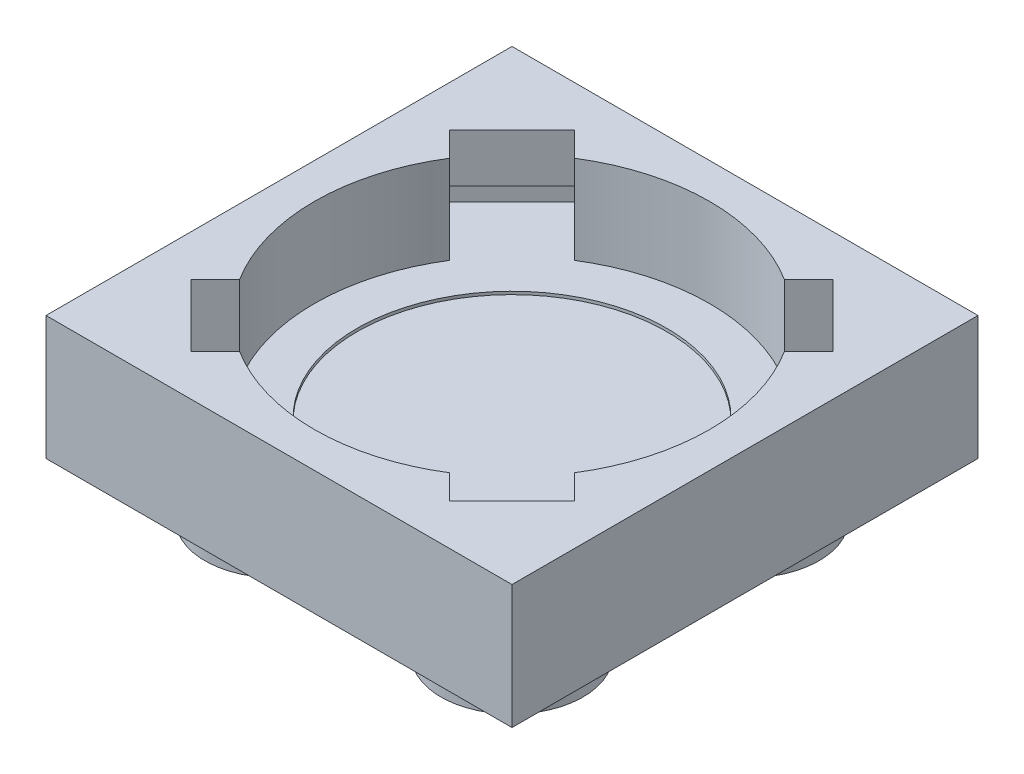
ISO-10303-21;
HEADER;
FILE_DESCRIPTION(('STEP AP214'),'2;1');
FILE_NAME('part.step','',(''),(''),'','','');
FILE_SCHEMA(('AUTOMOTIVE_DESIGN { 1 0 10303 214 1 1 1 1 }'));
ENDSEC;
DATA;
#1=APPLICATION_CONTEXT('core data for automotive mechanical design processes');
#2=APPLICATION_PROTOCOL_DEFINITION('international standard','automotive_design',2000,#1);
#3=PRODUCT_CONTEXT('',#1,'mechanical');
#4=PRODUCT('Part','Part','',(#3));
#5=PRODUCT_RELATED_PRODUCT_CATEGORY('part','',(#4));
#6=PRODUCT_DEFINITION_FORMATION('','',#4);
#7=PRODUCT_DEFINITION_CONTEXT('part definition',#1,'design');
#8=PRODUCT_DEFINITION('design','',#6,#7);
#9=PRODUCT_DEFINITION_SHAPE('','',#8);
#10=(LENGTH_UNIT() NAMED_UNIT(*) SI_UNIT(.MILLI.,.METRE.));
#11=(NAMED_UNIT(*) PLANE_ANGLE_UNIT() SI_UNIT($,.RADIAN.));
#12=(NAMED_UNIT(*) SI_UNIT($,.STERADIAN.) SOLID_ANGLE_UNIT());
#13=UNCERTAINTY_MEASURE_WITH_UNIT(LENGTH_MEASURE(1.E-05),#10,'distance_accuracy_value','');
#14=(GEOMETRIC_REPRESENTATION_CONTEXT(3) GLOBAL_UNCERTAINTY_ASSIGNED_CONTEXT((#13)) GLOBAL_UNIT_ASSIGNED_CONTEXT((#10,
#11,#12)) REPRESENTATION_CONTEXT('',''));
#15=CARTESIAN_POINT('',(0.,0.,0.));
#16=DIRECTION('',(0.,0.,1.));
#17=DIRECTION('',(1.,0.,0.));
#18=AXIS2_PLACEMENT_3D('',#15,#16,#17);
#19=CARTESIAN_POINT('',(7.9,9.47523086789974,-7.9));
#20=DIRECTION('',(0.,-1.,0.));
#21=DIRECTION('',(0.,0.,-1.));
#22=AXIS2_PLACEMENT_3D('',#19,#20,#21);
#23=CYLINDRICAL_SURFACE('',#22,6.7);
#24=CARTESIAN_POINT('',(7.9,-3.,-7.9));
#25=DIRECTION('',(0.,1.,0.));
#26=DIRECTION('',(0.,0.,1.));
#27=AXIS2_PLACEMENT_3D('',#24,#25,#26);
#28=CIRCLE('',#27,6.7);
#29=CARTESIAN_POINT('',(11.4566983804663,-3.,-13.5780187240259));
#30=VERTEX_POINT('',#29);
#31=CARTESIAN_POINT('',(4.34330161953375,-3.,-13.5780187240259));
#32=VERTEX_POINT('',#31);
#33=EDGE_CURVE('E396',#30,#32,#28,.T.);
#34=ORIENTED_EDGE('',*,*,#33,.F.);
#35=DIRECTION('',(0.,-1.,0.));
#36=VECTOR('',#35,1.);
#37=CARTESIAN_POINT('',(11.4566983804663,9.47523086789974,-13.5780187240259));
#38=LINE('',#37,#36);
#39=CARTESIAN_POINT('',(11.4566983804663,0.,-13.5780187240259));
#40=VERTEX_POINT('',#39);
#41=EDGE_CURVE('E81',#30,#40,#38,.F.);
#42=ORIENTED_EDGE('',*,*,#41,.T.);
#43=CARTESIAN_POINT('',(7.9,0.,-7.9));
#44=DIRECTION('',(0.,-1.,0.));
#45=DIRECTION('',(0.,0.,-1.));
#46=AXIS2_PLACEMENT_3D('',#43,#44,#45);
#47=CIRCLE('',#46,6.7);
#48=CARTESIAN_POINT('',(4.34330161953375,0.,-13.5780187240259));
#49=VERTEX_POINT('',#48);
#50=EDGE_CURVE('E410',#49,#40,#47,.T.);
#51=ORIENTED_EDGE('',*,*,#50,.F.);
#52=DIRECTION('',(0.,-1.,0.));
#53=VECTOR('',#52,1.);
#54=CARTESIAN_POINT('',(4.34330161953375,9.47523086789974,-13.5780187240259));
#55=LINE('',#54,#53);
#56=EDGE_CURVE('E484',#32,#49,#55,.F.);
#57=ORIENTED_EDGE('',*,*,#56,.F.);
#58=EDGE_LOOP('',(#34,#42,#51,#57));
#59=FACE_BOUND('',#58,.T.);
#60=ADVANCED_FACE('F73',(#59),#23,.F.);
#61=DIRECTION('',(0.,-1.,0.));
#62=VECTOR('',#61,1.);
#63=CARTESIAN_POINT('',(13.5780187240259,9.47523086789974,-11.4566983804662));
#64=LINE('',#63,#62);
#65=CARTESIAN_POINT('',(13.5780187240259,-3.,-11.4566983804662));
#66=VERTEX_POINT('',#65);
#67=CARTESIAN_POINT('',(13.5780187240259,0.,-11.4566983804662));
#68=VERTEX_POINT('',#67);
#69=EDGE_CURVE('E13',#66,#68,#64,.F.);
#70=ORIENTED_EDGE('',*,*,#69,.F.);
#71=CARTESIAN_POINT('',(13.5780187240259,-3.,-4.34330161953374));
#72=VERTEX_POINT('',#71);
#73=EDGE_CURVE('E510',#72,#66,#28,.T.);
#74=ORIENTED_EDGE('',*,*,#73,.F.);
#75=DIRECTION('',(0.,-1.,0.));
#76=VECTOR('',#75,1.);
#77=CARTESIAN_POINT('',(13.5780187240259,9.47523086789974,-4.34330161953374));
#78=LINE('',#77,#76);
#79=CARTESIAN_POINT('',(13.5780187240259,0.,-4.34330161953374));
#80=VERTEX_POINT('',#79);
#81=EDGE_CURVE('E491',#72,#80,#78,.F.);
#82=ORIENTED_EDGE('',*,*,#81,.T.);
#83=EDGE_CURVE('E414',#68,#80,#47,.T.);
#84=ORIENTED_EDGE('',*,*,#83,.F.);
#85=EDGE_LOOP('',(#70,#74,#82,#84));
#86=FACE_BOUND('',#85,.T.);
#87=ADVANCED_FACE('F543',(#86),#23,.F.);
#88=DIRECTION('',(0.,-1.,0.));
#89=VECTOR('',#88,1.);
#90=CARTESIAN_POINT('',(11.4566983804663,9.47523086789974,-2.2219812759741));
#91=LINE('',#90,#89);
#92=CARTESIAN_POINT('',(11.4566983804663,-3.,-2.2219812759741));
#93=VERTEX_POINT('',#92);
#94=CARTESIAN_POINT('',(11.4566983804663,0.,-2.2219812759741));
#95=VERTEX_POINT('',#94);
#96=EDGE_CURVE('E494',#93,#95,#91,.F.);
#97=ORIENTED_EDGE('',*,*,#96,.F.);
#98=CARTESIAN_POINT('',(4.34330161953368,-3.,-2.22198127597414));
#99=VERTEX_POINT('',#98);
#100=EDGE_CURVE('E419',#99,#93,#28,.T.);
#101=ORIENTED_EDGE('',*,*,#100,.F.);
#102=DIRECTION('',(0.,-1.,0.));
#103=VECTOR('',#102,1.);
#104=CARTESIAN_POINT('',(4.34330161953368,9.47523086789974,-2.22198127597414));
#105=LINE('',#104,#103);
#106=CARTESIAN_POINT('',(4.34330161953368,0.,-2.22198127597414));
#107=VERTEX_POINT('',#106);
#108=EDGE_CURVE('E486',#99,#107,#105,.F.);
#109=ORIENTED_EDGE('',*,*,#108,.T.);
#110=EDGE_CURVE('E524',#95,#107,#47,.T.);
#111=ORIENTED_EDGE('',*,*,#110,.F.);
#112=EDGE_LOOP('',(#97,#101,#109,#111));
#113=FACE_BOUND('',#112,.T.);
#114=ADVANCED_FACE('F521',(#113),#23,.F.);
#115=CARTESIAN_POINT('',(0.,-3.,0.));
#116=DIRECTION('',(0.,-1.,0.));
#117=DIRECTION('',(0.,0.,-1.));
#118=AXIS2_PLACEMENT_3D('',#115,#116,#117);
#119=PLANE('',#118);
#120=CARTESIAN_POINT('',(7.9,-3.,-7.9));
#121=DIRECTION('',(0.,1.,0.));
#122=DIRECTION('',(0.,0.,1.));
#123=AXIS2_PLACEMENT_3D('',#120,#121,#122);
#124=CIRCLE('',#123,5.25);
#125=CARTESIAN_POINT('',(7.9,-3.,-2.65));
#126=VERTEX_POINT('',#125);
#127=EDGE_CURVE('E413',#126,#126,#124,.T.);
#128=ORIENTED_EDGE('',*,*,#127,.F.);
#129=EDGE_LOOP('',(#128));
#130=FACE_BOUND('',#129,.T.);
#131=ORIENTED_EDGE('',*,*,#73,.T.);
#132=DIRECTION('',(0.707106781186549,0.,-0.707106781186546));
#133=VECTOR('',#132,1.);
#134=CARTESIAN_POINT('',(8.96066017177984,-3.,-6.83933982822018));
#135=LINE('',#134,#133);
#136=CARTESIAN_POINT('',(15.2892658633994,-3.,-13.1679455198398));
#137=VERTEX_POINT('',#136);
#138=EDGE_CURVE('E274',#66,#137,#135,.T.);
#139=ORIENTED_EDGE('',*,*,#138,.T.);
#140=DIRECTION('',(0.707106781186545,0.,0.70710678118655));
#141=VECTOR('',#140,1.);
#142=CARTESIAN_POINT('',(13.1679455198398,-3.,-15.2892658633994));
#143=LINE('',#142,#141);
#144=CARTESIAN_POINT('',(13.1679455198398,-3.,-15.2892658633994));
#145=VERTEX_POINT('',#144);
#146=EDGE_CURVE('E271',#145,#137,#143,.T.);
#147=ORIENTED_EDGE('',*,*,#146,.F.);
#148=DIRECTION('',(0.707106781186551,0.,-0.707106781186544));
#149=VECTOR('',#148,1.);
#150=CARTESIAN_POINT('',(6.83933982822017,-3.,-8.96066017177982));
#151=LINE('',#150,#149);
#152=EDGE_CURVE('E257',#30,#145,#151,.T.);
#153=ORIENTED_EDGE('',*,*,#152,.F.);
#154=ORIENTED_EDGE('',*,*,#33,.T.);
#155=DIRECTION('',(-0.707106781186549,0.,-0.707106781186546));
#156=VECTOR('',#155,1.);
#157=CARTESIAN_POINT('',(8.96066017177982,-3.,-8.96066017177984));
#158=LINE('',#157,#156);
#159=CARTESIAN_POINT('',(2.63205448016022,-3.,-15.2892658633994));
#160=VERTEX_POINT('',#159);
#161=EDGE_CURVE('E404',#32,#160,#158,.T.);
#162=ORIENTED_EDGE('',*,*,#161,.T.);
#163=DIRECTION('',(0.707106781186548,0.,-0.707106781186547));
#164=VECTOR('',#163,1.);
#165=CARTESIAN_POINT('',(0.51073413660058,-3.,-13.1679455198398));
#166=LINE('',#165,#164);
#167=CARTESIAN_POINT('',(0.51073413660058,-3.,-13.1679455198398));
#168=VERTEX_POINT('',#167);
#169=EDGE_CURVE('E377',#168,#160,#166,.T.);
#170=ORIENTED_EDGE('',*,*,#169,.F.);
#171=DIRECTION('',(-0.707106781186547,0.,-0.707106781186548));
#172=VECTOR('',#171,1.);
#173=CARTESIAN_POINT('',(6.83933982822018,-3.,-6.83933982822017));
#174=LINE('',#173,#172);
#175=CARTESIAN_POINT('',(2.2219812759741,-3.,-11.4566983804663));
#176=VERTEX_POINT('',#175);
#177=EDGE_CURVE('E391',#176,#168,#174,.T.);
#178=ORIENTED_EDGE('',*,*,#177,.F.);
#179=CARTESIAN_POINT('',(2.22198127597406,-3.,-4.34330161953381));
#180=VERTEX_POINT('',#179);
#181=EDGE_CURVE('E416',#176,#180,#28,.T.);
#182=ORIENTED_EDGE('',*,*,#181,.T.);
#183=DIRECTION('',(-0.707106781186554,0.,0.707106781186541));
#184=VECTOR('',#183,1.);
#185=CARTESIAN_POINT('',(6.83933982822017,-3.,-8.96066017177983));
#186=LINE('',#185,#184);
#187=CARTESIAN_POINT('',(0.510734136600525,-3.,-2.63205448016029));
#188=VERTEX_POINT('',#187);
#189=EDGE_CURVE('E368',#180,#188,#186,.T.);
#190=ORIENTED_EDGE('',*,*,#189,.T.);
#191=DIRECTION('',(-0.70710678118654,0.,-0.707106781186555));
#192=VECTOR('',#191,1.);
#193=CARTESIAN_POINT('',(2.63205448016014,-3.,-0.510734136600635));
#194=LINE('',#193,#192);
#195=CARTESIAN_POINT('',(2.63205448016014,-3.,-0.510734136600635));
#196=VERTEX_POINT('',#195);
#197=EDGE_CURVE('E315',#196,#188,#194,.T.);
#198=ORIENTED_EDGE('',*,*,#197,.F.);
#199=DIRECTION('',(-0.707106781186556,0.,0.707106781186539));
#200=VECTOR('',#199,1.);
#201=CARTESIAN_POINT('',(8.96066017177982,-3.,-6.83933982822017));
#202=LINE('',#201,#200);
#203=EDGE_CURVE('E293',#99,#196,#202,.T.);
#204=ORIENTED_EDGE('',*,*,#203,.F.);
#205=ORIENTED_EDGE('',*,*,#100,.T.);
#206=DIRECTION('',(0.707106781186549,0.,0.707106781186546));
#207=VECTOR('',#206,1.);
#208=CARTESIAN_POINT('',(6.83933982822018,-3.,-6.83933982822016));
#209=LINE('',#208,#207);
#210=CARTESIAN_POINT('',(13.1679455198398,-3.,-0.510734136600581));
#211=VERTEX_POINT('',#210);
#212=EDGE_CURVE('E351',#93,#211,#209,.T.);
#213=ORIENTED_EDGE('',*,*,#212,.T.);
#214=DIRECTION('',(-0.707106781186548,0.,0.707106781186547));
#215=VECTOR('',#214,1.);
#216=CARTESIAN_POINT('',(15.2892658633994,-3.,-2.63205448016022));
#217=LINE('',#216,#215);
#218=CARTESIAN_POINT('',(15.2892658633994,-3.,-2.63205448016022));
#219=VERTEX_POINT('',#218);
#220=EDGE_CURVE('E298',#219,#211,#217,.T.);
#221=ORIENTED_EDGE('',*,*,#220,.F.);
#222=DIRECTION('',(0.707106781186547,0.,0.707106781186548));
#223=VECTOR('',#222,1.);
#224=CARTESIAN_POINT('',(8.96066017177982,-3.,-8.96066017177983));
#225=LINE('',#224,#223);
#226=EDGE_CURVE('E352',#72,#219,#225,.T.);
#227=ORIENTED_EDGE('',*,*,#226,.F.);
#228=EDGE_LOOP('',(#131,#139,#147,#153,#154,#162,#170,#178,#182,#190,#198,#204,#205,#213,#221,#227));
#229=FACE_BOUND('',#228,.T.);
#230=ADVANCED_FACE('F273',(#130,#229),#119,.F.);
#231=CARTESIAN_POINT('',(3.9,-6.,-3.9));
#232=DIRECTION('',(0.,-1.,0.));
#233=DIRECTION('',(0.,0.,-1.));
#234=AXIS2_PLACEMENT_3D('',#231,#232,#233);
#235=PLANE('',#234);
#236=CARTESIAN_POINT('',(3.9,-6.,-3.9));
#237=DIRECTION('',(0.,-1.,0.));
#238=DIRECTION('',(0.,0.,-1.));
#239=AXIS2_PLACEMENT_3D('',#236,#237,#238);
#240=CIRCLE('',#239,2.41);
#241=CARTESIAN_POINT('',(3.9,-6.,-6.31));
#242=VERTEX_POINT('',#241);
#243=EDGE_CURVE('E478',#242,#242,#240,.T.);
#244=ORIENTED_EDGE('',*,*,#243,.T.);
#245=EDGE_LOOP('',(#244));
#246=FACE_BOUND('',#245,.T.);
#247=ADVANCED_FACE('F75',(#246),#235,.T.);
#248=CARTESIAN_POINT('',(3.9,-6.,-3.9));
#249=DIRECTION('',(0.,1.,0.));
#250=DIRECTION('',(0.,0.,1.));
#251=AXIS2_PLACEMENT_3D('',#248,#249,#250);
#252=CYLINDRICAL_SURFACE('',#251,2.41);
#253=ORIENTED_EDGE('',*,*,#243,.F.);
#254=EDGE_LOOP('',(#253));
#255=FACE_BOUND('',#254,.T.);
#256=CARTESIAN_POINT('',(3.9,-4.2,-3.9));
#257=DIRECTION('',(0.,-1.,0.));
#258=DIRECTION('',(0.,0.,-1.));
#259=AXIS2_PLACEMENT_3D('',#256,#257,#258);
#260=CIRCLE('',#259,2.41);
#261=CARTESIAN_POINT('',(3.9,-4.2,-6.31));
#262=VERTEX_POINT('',#261);
#263=EDGE_CURVE('E475',#262,#262,#260,.T.);
#264=ORIENTED_EDGE('',*,*,#263,.T.);
#265=EDGE_LOOP('',(#264));
#266=FACE_BOUND('',#265,.T.);
#267=ADVANCED_FACE('F593',(#255,#266),#252,.T.);
#268=CARTESIAN_POINT('',(3.9,-6.,-11.9));
#269=DIRECTION('',(0.,-1.,0.));
#270=DIRECTION('',(0.,0.,-1.));
#271=AXIS2_PLACEMENT_3D('',#268,#269,#270);
#272=PLANE('',#271);
#273=CARTESIAN_POINT('',(3.9,-6.,-11.9));
#274=DIRECTION('',(0.,-1.,0.));
#275=DIRECTION('',(0.,0.,-1.));
#276=AXIS2_PLACEMENT_3D('',#273,#274,#275);
#277=CIRCLE('',#276,2.41);
#278=CARTESIAN_POINT('',(3.9,-6.,-14.31));
#279=VERTEX_POINT('',#278);
#280=EDGE_CURVE('E472',#279,#279,#277,.T.);
#281=ORIENTED_EDGE('',*,*,#280,.T.);
#282=EDGE_LOOP('',(#281));
#283=FACE_BOUND('',#282,.T.);
#284=ADVANCED_FACE('F625',(#283),#272,.T.);
#285=CARTESIAN_POINT('',(3.9,-6.,-11.9));
#286=DIRECTION('',(0.,1.,0.));
#287=DIRECTION('',(0.,0.,1.));
#288=AXIS2_PLACEMENT_3D('',#285,#286,#287);
#289=CYLINDRICAL_SURFACE('',#288,2.41);
#290=ORIENTED_EDGE('',*,*,#280,.F.);
#291=EDGE_LOOP('',(#290));
#292=FACE_BOUND('',#291,.T.);
#293=CARTESIAN_POINT('',(3.9,-4.2,-11.9));
#294=DIRECTION('',(0.,-1.,0.));
#295=DIRECTION('',(0.,0.,-1.));
#296=AXIS2_PLACEMENT_3D('',#293,#294,#295);
#297=CIRCLE('',#296,2.41);
#298=CARTESIAN_POINT('',(3.9,-4.2,-14.31));
#299=VERTEX_POINT('',#298);
#300=EDGE_CURVE('E464',#299,#299,#297,.T.);
#301=ORIENTED_EDGE('',*,*,#300,.T.);
#302=EDGE_LOOP('',(#301));
#303=FACE_BOUND('',#302,.T.);
#304=ADVANCED_FACE('F621',(#292,#303),#289,.T.);
#305=CARTESIAN_POINT('',(0.,-4.2,0.));
#306=DIRECTION('',(-1.,0.,0.));
#307=DIRECTION('',(0.,0.,1.));
#308=AXIS2_PLACEMENT_3D('',#305,#306,#307);
#309=PLANE('',#308);
#310=DIRECTION('',(0.,0.,1.));
#311=VECTOR('',#310,1.);
#312=CARTESIAN_POINT('',(0.,0.,0.));
#313=LINE('',#312,#311);
#314=CARTESIAN_POINT('',(0.,0.,-15.8));
#315=VERTEX_POINT('',#314);
#316=CARTESIAN_POINT('',(0.,0.,0.));
#317=VERTEX_POINT('',#316);
#318=EDGE_CURVE('E435',#315,#317,#313,.T.);
#319=ORIENTED_EDGE('',*,*,#318,.F.);
#320=DIRECTION('',(0.,1.,0.));
#321=VECTOR('',#320,1.);
#322=CARTESIAN_POINT('',(0.,-4.2,-15.8));
#323=LINE('',#322,#321);
#324=CARTESIAN_POINT('',(0.,-4.2,-15.8));
#325=VERTEX_POINT('',#324);
#326=EDGE_CURVE('E462',#325,#315,#323,.T.);
#327=ORIENTED_EDGE('',*,*,#326,.F.);
#328=DIRECTION('',(0.,0.,1.));
#329=VECTOR('',#328,1.);
#330=CARTESIAN_POINT('',(0.,-4.2,0.));
#331=LINE('',#330,#329);
#332=CARTESIAN_POINT('',(0.,-4.2,0.));
#333=VERTEX_POINT('',#332);
#334=EDGE_CURVE('E438',#325,#333,#331,.T.);
#335=ORIENTED_EDGE('',*,*,#334,.T.);
#336=DIRECTION('',(0.,1.,0.));
#337=VECTOR('',#336,1.);
#338=CARTESIAN_POINT('',(0.,-4.2,0.));
#339=LINE('',#338,#337);
#340=EDGE_CURVE('E451',#333,#317,#339,.T.);
#341=ORIENTED_EDGE('',*,*,#340,.T.);
#342=EDGE_LOOP('',(#319,#327,#335,#341));
#343=FACE_BOUND('',#342,.T.);
#344=ADVANCED_FACE('F611',(#343),#309,.T.);
#345=CARTESIAN_POINT('',(0.,-4.2,-15.8));
#346=DIRECTION('',(0.,0.,-1.));
#347=DIRECTION('',(-1.,0.,0.));
#348=AXIS2_PLACEMENT_3D('',#345,#346,#347);
#349=PLANE('',#348);
#350=DIRECTION('',(-1.,0.,0.));
#351=VECTOR('',#350,1.);
#352=CARTESIAN_POINT('',(0.,0.,-15.8));
#353=LINE('',#352,#351);
#354=CARTESIAN_POINT('',(15.8,0.,-15.8));
#355=VERTEX_POINT('',#354);
#356=EDGE_CURVE('E442',#355,#315,#353,.T.);
#357=ORIENTED_EDGE('',*,*,#356,.F.);
#358=DIRECTION('',(0.,1.,0.));
#359=VECTOR('',#358,1.);
#360=CARTESIAN_POINT('',(15.8,-4.2,-15.8));
#361=LINE('',#360,#359);
#362=CARTESIAN_POINT('',(15.8,-4.2,-15.8));
#363=VERTEX_POINT('',#362);
#364=EDGE_CURVE('E465',#363,#355,#361,.T.);
#365=ORIENTED_EDGE('',*,*,#364,.F.);
#366=DIRECTION('',(-1.,0.,0.));
#367=VECTOR('',#366,1.);
#368=CARTESIAN_POINT('',(0.,-4.2,-15.8));
#369=LINE('',#368,#367);
#370=EDGE_CURVE('E448',#363,#325,#369,.T.);
#371=ORIENTED_EDGE('',*,*,#370,.T.);
#372=ORIENTED_EDGE('',*,*,#326,.T.);
#373=EDGE_LOOP('',(#357,#365,#371,#372));
#374=FACE_BOUND('',#373,.T.);
#375=ADVANCED_FACE('F607',(#374),#349,.T.);
#376=CARTESIAN_POINT('',(15.8,-4.2,0.));
#377=DIRECTION('',(1.,0.,0.));
#378=DIRECTION('',(0.,0.,-1.));
#379=AXIS2_PLACEMENT_3D('',#376,#377,#378);
#380=PLANE('',#379);
#381=DIRECTION('',(0.,0.,-1.));
#382=VECTOR('',#381,1.);
#383=CARTESIAN_POINT('',(15.8,0.,0.));
#384=LINE('',#383,#382);
#385=CARTESIAN_POINT('',(15.8,0.,0.));
#386=VERTEX_POINT('',#385);
#387=EDGE_CURVE('E457',#386,#355,#384,.T.);
#388=ORIENTED_EDGE('',*,*,#387,.F.);
#389=DIRECTION('',(0.,1.,0.));
#390=VECTOR('',#389,1.);
#391=CARTESIAN_POINT('',(15.8,-4.2,0.));
#392=LINE('',#391,#390);
#393=CARTESIAN_POINT('',(15.8,-4.2,0.));
#394=VERTEX_POINT('',#393);
#395=EDGE_CURVE('E467',#394,#386,#392,.T.);
#396=ORIENTED_EDGE('',*,*,#395,.F.);
#397=DIRECTION('',(0.,0.,-1.));
#398=VECTOR('',#397,1.);
#399=CARTESIAN_POINT('',(15.8,-4.2,0.));
#400=LINE('',#399,#398);
#401=EDGE_CURVE('E445',#394,#363,#400,.T.);
#402=ORIENTED_EDGE('',*,*,#401,.T.);
#403=ORIENTED_EDGE('',*,*,#364,.T.);
#404=EDGE_LOOP('',(#388,#396,#402,#403));
#405=FACE_BOUND('',#404,.T.);
#406=ADVANCED_FACE('F610',(#405),#380,.T.);
#407=CARTESIAN_POINT('',(0.,-4.2,0.));
#408=DIRECTION('',(0.,0.,1.));
#409=DIRECTION('',(1.,0.,0.));
#410=AXIS2_PLACEMENT_3D('',#407,#408,#409);
#411=PLANE('',#410);
#412=DIRECTION('',(1.,0.,0.));
#413=VECTOR('',#412,1.);
#414=CARTESIAN_POINT('',(0.,0.,0.));
#415=LINE('',#414,#413);
#416=EDGE_CURVE('E454',#317,#386,#415,.T.);
#417=ORIENTED_EDGE('',*,*,#416,.F.);
#418=ORIENTED_EDGE('',*,*,#340,.F.);
#419=DIRECTION('',(1.,0.,0.));
#420=VECTOR('',#419,1.);
#421=CARTESIAN_POINT('',(0.,-4.2,0.));
#422=LINE('',#421,#420);
#423=EDGE_CURVE('E441',#333,#394,#422,.T.);
#424=ORIENTED_EDGE('',*,*,#423,.T.);
#425=ORIENTED_EDGE('',*,*,#395,.T.);
#426=EDGE_LOOP('',(#417,#418,#424,#425));
#427=FACE_BOUND('',#426,.T.);
#428=ADVANCED_FACE('F603',(#427),#411,.T.);
#429=CARTESIAN_POINT('',(0.,-4.2,0.));
#430=DIRECTION('',(0.,-1.,0.));
#431=DIRECTION('',(0.,0.,-1.));
#432=AXIS2_PLACEMENT_3D('',#429,#430,#431);
#433=PLANE('',#432);
#434=CARTESIAN_POINT('',(11.9,-4.2,-3.9));
#435=DIRECTION('',(0.,-1.,0.));
#436=DIRECTION('',(0.,0.,-1.));
#437=AXIS2_PLACEMENT_3D('',#434,#435,#436);
#438=CIRCLE('',#437,2.41);
#439=CARTESIAN_POINT('',(11.9,-4.2,-6.31));
#440=VERTEX_POINT('',#439);
#441=EDGE_CURVE('E423',#440,#440,#438,.T.);
#442=ORIENTED_EDGE('',*,*,#441,.F.);
#443=EDGE_LOOP('',(#442));
#444=FACE_BOUND('',#443,.T.);
#445=CARTESIAN_POINT('',(11.9,-4.2,-11.9));
#446=DIRECTION('',(0.,-1.,0.));
#447=DIRECTION('',(0.,0.,-1.));
#448=AXIS2_PLACEMENT_3D('',#445,#446,#447);
#449=CIRCLE('',#448,2.41);
#450=CARTESIAN_POINT('',(11.9,-4.2,-14.31));
#451=VERTEX_POINT('',#450);
#452=EDGE_CURVE('E431',#451,#451,#449,.T.);
#453=ORIENTED_EDGE('',*,*,#452,.F.);
#454=EDGE_LOOP('',(#453));
#455=FACE_BOUND('',#454,.T.);
#456=ORIENTED_EDGE('',*,*,#334,.F.);
#457=ORIENTED_EDGE('',*,*,#370,.F.);
#458=ORIENTED_EDGE('',*,*,#401,.F.);
#459=ORIENTED_EDGE('',*,*,#423,.F.);
#460=EDGE_LOOP('',(#456,#457,#458,#459));
#461=FACE_BOUND('',#460,.T.);
#462=ORIENTED_EDGE('',*,*,#300,.F.);
#463=EDGE_LOOP('',(#462));
#464=FACE_BOUND('',#463,.T.);
#465=ORIENTED_EDGE('',*,*,#263,.F.);
#466=EDGE_LOOP('',(#465));
#467=FACE_BOUND('',#466,.T.);
#468=ADVANCED_FACE('F600',(#444,#455,#461,#464,#467),#433,.T.);
#469=CARTESIAN_POINT('',(0.,0.,0.));
#470=DIRECTION('',(0.,-1.,0.));
#471=DIRECTION('',(0.,0.,-1.));
#472=AXIS2_PLACEMENT_3D('',#469,#470,#471);
#473=PLANE('',#472);
#474=DIRECTION('',(0.707106781186545,0.,0.70710678118655));
#475=VECTOR('',#474,1.);
#476=CARTESIAN_POINT('',(5.44472221513646,0.,-21.2447222151364));
#477=LINE('',#476,#475);
#478=CARTESIAN_POINT('',(12.2840620433566,0.,-14.4053823869162));
#479=VERTEX_POINT('',#478);
#480=CARTESIAN_POINT('',(14.4053823869163,0.,-12.2840620433566));
#481=VERTEX_POINT('',#480);
#482=EDGE_CURVE('E332',#479,#481,#477,.T.);
#483=ORIENTED_EDGE('',*,*,#482,.T.);
#484=DIRECTION('',(0.707106781186549,0.,-0.707106781186546));
#485=VECTOR('',#484,1.);
#486=CARTESIAN_POINT('',(8.96066017177984,0.,-6.83933982822018));
#487=LINE('',#486,#485);
#488=EDGE_CURVE('E267',#68,#481,#487,.T.);
#489=ORIENTED_EDGE('',*,*,#488,.F.);
#490=ORIENTED_EDGE('',*,*,#83,.T.);
#491=DIRECTION('',(0.707106781186547,0.,0.707106781186548));
#492=VECTOR('',#491,1.);
#493=CARTESIAN_POINT('',(8.96066017177982,0.,-8.96066017177983));
#494=LINE('',#493,#492);
#495=CARTESIAN_POINT('',(14.4053823869162,0.,-3.5159379566434));
#496=VERTEX_POINT('',#495);
#497=EDGE_CURVE('E268',#80,#496,#494,.T.);
#498=ORIENTED_EDGE('',*,*,#497,.T.);
#499=DIRECTION('',(-0.707106781186547,0.,0.707106781186548));
#500=VECTOR('',#499,1.);
#501=CARTESIAN_POINT('',(21.2447222151364,0.,-10.3552777848636));
#502=LINE('',#501,#500);
#503=CARTESIAN_POINT('',(12.2840620433566,0.,-1.39461761308376));
#504=VERTEX_POINT('',#503);
#505=EDGE_CURVE('E344',#496,#504,#502,.T.);
#506=ORIENTED_EDGE('',*,*,#505,.T.);
#507=DIRECTION('',(0.707106781186549,0.,0.707106781186546));
#508=VECTOR('',#507,1.);
#509=CARTESIAN_POINT('',(6.83933982822018,0.,-6.83933982822016));
#510=LINE('',#509,#508);
#511=EDGE_CURVE('E348',#95,#504,#510,.T.);
#512=ORIENTED_EDGE('',*,*,#511,.F.);
#513=ORIENTED_EDGE('',*,*,#110,.T.);
#514=DIRECTION('',(-0.707106781186556,0.,0.707106781186539));
#515=VECTOR('',#514,1.);
#516=CARTESIAN_POINT('',(8.96066017177982,0.,-6.83933982822017));
#517=LINE('',#516,#515);
#518=CARTESIAN_POINT('',(3.51593795664333,0.,-1.39461761308381));
#519=VERTEX_POINT('',#518);
#520=EDGE_CURVE('E356',#107,#519,#517,.T.);
#521=ORIENTED_EDGE('',*,*,#520,.T.);
#522=DIRECTION('',(-0.70710678118654,0.,-0.707106781186555));
#523=VECTOR('',#522,1.);
#524=CARTESIAN_POINT('',(10.3552777848634,0.,5.44472221513644));
#525=LINE('',#524,#523);
#526=CARTESIAN_POINT('',(1.39461761308372,0.,-3.51593795664347));
#527=VERTEX_POINT('',#526);
#528=EDGE_CURVE('E361',#519,#527,#525,.T.);
#529=ORIENTED_EDGE('',*,*,#528,.T.);
#530=DIRECTION('',(-0.707106781186554,0.,0.707106781186541));
#531=VECTOR('',#530,1.);
#532=CARTESIAN_POINT('',(6.83933982822017,0.,-8.96066017177983));
#533=LINE('',#532,#531);
#534=CARTESIAN_POINT('',(2.22198127597406,0.,-4.34330161953381));
#535=VERTEX_POINT('',#534);
#536=EDGE_CURVE('E365',#535,#527,#533,.T.);
#537=ORIENTED_EDGE('',*,*,#536,.F.);
#538=CARTESIAN_POINT('',(2.2219812759741,0.,-11.4566983804663));
#539=VERTEX_POINT('',#538);
#540=EDGE_CURVE('E415',#535,#539,#47,.T.);
#541=ORIENTED_EDGE('',*,*,#540,.T.);
#542=DIRECTION('',(-0.707106781186547,0.,-0.707106781186548));
#543=VECTOR('',#542,1.);
#544=CARTESIAN_POINT('',(6.83933982822018,0.,-6.83933982822017));
#545=LINE('',#544,#543);
#546=CARTESIAN_POINT('',(1.39461761308377,0.,-12.2840620433566));
#547=VERTEX_POINT('',#546);
#548=EDGE_CURVE('E393',#539,#547,#545,.T.);
#549=ORIENTED_EDGE('',*,*,#548,.T.);
#550=DIRECTION('',(0.707106781186547,0.,-0.707106781186548));
#551=VECTOR('',#550,1.);
#552=CARTESIAN_POINT('',(-5.44472221513642,0.,-5.44472221513641));
#553=LINE('',#552,#551);
#554=CARTESIAN_POINT('',(3.5159379566434,0.,-14.4053823869162));
#555=VERTEX_POINT('',#554);
#556=EDGE_CURVE('E397',#547,#555,#553,.T.);
#557=ORIENTED_EDGE('',*,*,#556,.T.);
#558=DIRECTION('',(-0.707106781186549,0.,-0.707106781186546));
#559=VECTOR('',#558,1.);
#560=CARTESIAN_POINT('',(8.96066017177982,0.,-8.96066017177984));
#561=LINE('',#560,#559);
#562=EDGE_CURVE('E401',#49,#555,#561,.T.);
#563=ORIENTED_EDGE('',*,*,#562,.F.);
#564=ORIENTED_EDGE('',*,*,#50,.T.);
#565=DIRECTION('',(0.707106781186551,0.,-0.707106781186544));
#566=VECTOR('',#565,1.);
#567=CARTESIAN_POINT('',(6.83933982822017,0.,-8.96066017177982));
#568=LINE('',#567,#566);
#569=EDGE_CURVE('E328',#40,#479,#568,.T.);
#570=ORIENTED_EDGE('',*,*,#569,.T.);
#571=EDGE_LOOP('',(#483,#489,#490,#498,#506,#512,#513,#521,#529,#537,#541,#549,#557,#563,#564,#570));
#572=FACE_BOUND('',#571,.T.);
#573=ORIENTED_EDGE('',*,*,#318,.T.);
#574=ORIENTED_EDGE('',*,*,#416,.T.);
#575=ORIENTED_EDGE('',*,*,#387,.T.);
#576=ORIENTED_EDGE('',*,*,#356,.T.);
#577=EDGE_LOOP('',(#573,#574,#575,#576));
#578=FACE_BOUND('',#577,.T.);
#579=ADVANCED_FACE('F500',(#572,#578),#473,.F.);
#580=CARTESIAN_POINT('',(11.9,-6.,-11.9));
#581=DIRECTION('',(0.,1.,0.));
#582=DIRECTION('',(0.,0.,1.));
#583=AXIS2_PLACEMENT_3D('',#580,#581,#582);
#584=CYLINDRICAL_SURFACE('',#583,2.41);
#585=CARTESIAN_POINT('',(11.9,-6.,-11.9));
#586=DIRECTION('',(0.,-1.,0.));
#587=DIRECTION('',(0.,0.,-1.));
#588=AXIS2_PLACEMENT_3D('',#585,#586,#587);
#589=CIRCLE('',#588,2.41);
#590=CARTESIAN_POINT('',(11.9,-6.,-14.31));
#591=VERTEX_POINT('',#590);
#592=EDGE_CURVE('E432',#591,#591,#589,.T.);
#593=ORIENTED_EDGE('',*,*,#592,.F.);
#594=EDGE_LOOP('',(#593));
#595=FACE_BOUND('',#594,.T.);
#596=ORIENTED_EDGE('',*,*,#452,.T.);
#597=EDGE_LOOP('',(#596));
#598=FACE_BOUND('',#597,.T.);
#599=ADVANCED_FACE('F598',(#595,#598),#584,.T.);
#600=CARTESIAN_POINT('',(11.9,-6.,-11.9));
#601=DIRECTION('',(0.,-1.,0.));
#602=DIRECTION('',(0.,0.,-1.));
#603=AXIS2_PLACEMENT_3D('',#600,#601,#602);
#604=PLANE('',#603);
#605=ORIENTED_EDGE('',*,*,#592,.T.);
#606=EDGE_LOOP('',(#605));
#607=FACE_BOUND('',#606,.T.);
#608=ADVANCED_FACE('F678',(#607),#604,.T.);
#609=CARTESIAN_POINT('',(11.9,-6.,-3.9));
#610=DIRECTION('',(0.,1.,0.));
#611=DIRECTION('',(0.,0.,1.));
#612=AXIS2_PLACEMENT_3D('',#609,#610,#611);
#613=CYLINDRICAL_SURFACE('',#612,2.41);
#614=CARTESIAN_POINT('',(11.9,-6.,-3.9));
#615=DIRECTION('',(0.,-1.,0.));
#616=DIRECTION('',(0.,0.,-1.));
#617=AXIS2_PLACEMENT_3D('',#614,#615,#616);
#618=CIRCLE('',#617,2.41);
#619=CARTESIAN_POINT('',(11.9,-6.,-6.31));
#620=VERTEX_POINT('',#619);
#621=EDGE_CURVE('E428',#620,#620,#618,.T.);
#622=ORIENTED_EDGE('',*,*,#621,.F.);
#623=EDGE_LOOP('',(#622));
#624=FACE_BOUND('',#623,.T.);
#625=ORIENTED_EDGE('',*,*,#441,.T.);
#626=EDGE_LOOP('',(#625));
#627=FACE_BOUND('',#626,.T.);
#628=ADVANCED_FACE('F685',(#624,#627),#613,.T.);
#629=CARTESIAN_POINT('',(11.9,-6.,-3.9));
#630=DIRECTION('',(0.,-1.,0.));
#631=DIRECTION('',(0.,0.,-1.));
#632=AXIS2_PLACEMENT_3D('',#629,#630,#631);
#633=PLANE('',#632);
#634=ORIENTED_EDGE('',*,*,#621,.T.);
#635=EDGE_LOOP('',(#634));
#636=FACE_BOUND('',#635,.T.);
#637=ADVANCED_FACE('F691',(#636),#633,.T.);
#638=CARTESIAN_POINT('',(7.9,-3.1,-7.9));
#639=DIRECTION('',(0.,1.,0.));
#640=DIRECTION('',(0.,0.,1.));
#641=AXIS2_PLACEMENT_3D('',#638,#639,#640);
#642=CYLINDRICAL_SURFACE('',#641,5.25);
#643=CARTESIAN_POINT('',(7.9,-3.1,-7.9));
#644=DIRECTION('',(0.,1.,0.));
#645=DIRECTION('',(0.,0.,1.));
#646=AXIS2_PLACEMENT_3D('',#643,#644,#645);
#647=CIRCLE('',#646,5.25);
#648=CARTESIAN_POINT('',(7.9,-3.1,-2.65));
#649=VERTEX_POINT('',#648);
#650=EDGE_CURVE('E420',#649,#649,#647,.T.);
#651=ORIENTED_EDGE('',*,*,#650,.F.);
#652=EDGE_LOOP('',(#651));
#653=FACE_BOUND('',#652,.T.);
#654=ORIENTED_EDGE('',*,*,#127,.T.);
#655=EDGE_LOOP('',(#654));
#656=FACE_BOUND('',#655,.T.);
#657=ADVANCED_FACE('F581',(#653,#656),#642,.F.);
#658=CARTESIAN_POINT('',(7.9,-3.1,-7.9));
#659=DIRECTION('',(0.,1.,0.));
#660=DIRECTION('',(0.,0.,1.));
#661=AXIS2_PLACEMENT_3D('',#658,#659,#660);
#662=PLANE('',#661);
#663=ORIENTED_EDGE('',*,*,#650,.T.);
#664=EDGE_LOOP('',(#663));
#665=FACE_BOUND('',#664,.T.);
#666=ADVANCED_FACE('F574',(#665),#662,.T.);
#667=DIRECTION('',(0.,-1.,0.));
#668=VECTOR('',#667,1.);
#669=CARTESIAN_POINT('',(2.22198127597406,9.47523086789974,-4.34330161953381));
#670=LINE('',#669,#668);
#671=EDGE_CURVE('E489',#180,#535,#670,.F.);
#672=ORIENTED_EDGE('',*,*,#671,.F.);
#673=ORIENTED_EDGE('',*,*,#181,.F.);
#674=DIRECTION('',(0.,-1.,0.));
#675=VECTOR('',#674,1.);
#676=CARTESIAN_POINT('',(2.2219812759741,9.47523086789974,-11.4566983804663));
#677=LINE('',#676,#675);
#678=EDGE_CURVE('E481',#176,#539,#677,.F.);
#679=ORIENTED_EDGE('',*,*,#678,.T.);
#680=ORIENTED_EDGE('',*,*,#540,.F.);
#681=EDGE_LOOP('',(#672,#673,#679,#680));
#682=FACE_BOUND('',#681,.T.);
#683=ADVANCED_FACE('F567',(#682),#23,.F.);
#684=CARTESIAN_POINT('',(8.96066017177982,-8.65517446877458,-8.96066017177984));
#685=DIRECTION('',(0.707106781186546,0.,-0.707106781186549));
#686=DIRECTION('',(-0.707106781186549,0.,-0.707106781186546));
#687=AXIS2_PLACEMENT_3D('',#684,#685,#686);
#688=PLANE('',#687);
#689=ORIENTED_EDGE('',*,*,#56,.T.);
#690=ORIENTED_EDGE('',*,*,#562,.T.);
#691=DIRECTION('',(0.,1.,0.));
#692=VECTOR('',#691,1.);
#693=CARTESIAN_POINT('',(3.5159379566434,-8.65517446877458,-14.4053823869162));
#694=LINE('',#693,#692);
#695=CARTESIAN_POINT('',(3.5159379566434,-1.65,-14.4053823869162));
#696=VERTEX_POINT('',#695);
#697=EDGE_CURVE('E406',#696,#555,#694,.T.);
#698=ORIENTED_EDGE('',*,*,#697,.F.);
#699=DIRECTION('',(0.707106781186548,0.,0.707106781186547));
#700=VECTOR('',#699,1.);
#701=CARTESIAN_POINT('',(2.63205448016022,-1.65,-15.2892658633994));
#702=LINE('',#701,#700);
#703=CARTESIAN_POINT('',(2.63205448016022,-1.65,-15.2892658633994));
#704=VERTEX_POINT('',#703);
#705=EDGE_CURVE('E386',#704,#696,#702,.T.);
#706=ORIENTED_EDGE('',*,*,#705,.F.);
#707=DIRECTION('',(0.,1.,0.));
#708=VECTOR('',#707,1.);
#709=CARTESIAN_POINT('',(2.63205448016022,-3.,-15.2892658633994));
#710=LINE('',#709,#708);
#711=EDGE_CURVE('E380',#160,#704,#710,.T.);
#712=ORIENTED_EDGE('',*,*,#711,.F.);
#713=ORIENTED_EDGE('',*,*,#161,.F.);
#714=EDGE_LOOP('',(#689,#690,#698,#706,#712,#713));
#715=FACE_BOUND('',#714,.T.);
#716=ADVANCED_FACE('F505',(#715),#688,.F.);
#717=CARTESIAN_POINT('',(-5.44472221513642,-8.65517446877458,-5.44472221513641));
#718=DIRECTION('',(0.707106781186548,0.,0.707106781186547));
#719=DIRECTION('',(0.707106781186547,0.,-0.707106781186548));
#720=AXIS2_PLACEMENT_3D('',#717,#718,#719);
#721=PLANE('',#720);
#722=DIRECTION('',(-0.707106781186548,0.,0.707106781186547));
#723=VECTOR('',#722,1.);
#724=CARTESIAN_POINT('',(1.39461761308377,-1.65,-12.2840620433566));
#725=LINE('',#724,#723);
#726=CARTESIAN_POINT('',(1.39461761308377,-1.65,-12.2840620433566));
#727=VERTEX_POINT('',#726);
#728=EDGE_CURVE('E331',#696,#727,#725,.T.);
#729=ORIENTED_EDGE('',*,*,#728,.F.);
#730=ORIENTED_EDGE('',*,*,#697,.T.);
#731=ORIENTED_EDGE('',*,*,#556,.F.);
#732=DIRECTION('',(0.,1.,0.));
#733=VECTOR('',#732,1.);
#734=CARTESIAN_POINT('',(1.39461761308377,-8.65517446877458,-12.2840620433566));
#735=LINE('',#734,#733);
#736=EDGE_CURVE('E400',#727,#547,#735,.T.);
#737=ORIENTED_EDGE('',*,*,#736,.F.);
#738=EDGE_LOOP('',(#729,#730,#731,#737));
#739=FACE_BOUND('',#738,.T.);
#740=ADVANCED_FACE('F580',(#739),#721,.T.);
#741=CARTESIAN_POINT('',(6.83933982822018,-8.65517446877458,-6.83933982822017));
#742=DIRECTION('',(0.707106781186548,0.,-0.707106781186547));
#743=DIRECTION('',(-0.707106781186547,0.,-0.707106781186548));
#744=AXIS2_PLACEMENT_3D('',#741,#742,#743);
#745=PLANE('',#744);
#746=ORIENTED_EDGE('',*,*,#177,.T.);
#747=DIRECTION('',(0.,-1.,0.));
#748=VECTOR('',#747,1.);
#749=CARTESIAN_POINT('',(0.51073413660058,-3.,-13.1679455198398));
#750=LINE('',#749,#748);
#751=CARTESIAN_POINT('',(0.51073413660058,-1.65,-13.1679455198398));
#752=VERTEX_POINT('',#751);
#753=EDGE_CURVE('E374',#752,#168,#750,.T.);
#754=ORIENTED_EDGE('',*,*,#753,.F.);
#755=DIRECTION('',(0.707106781186548,0.,0.707106781186547));
#756=VECTOR('',#755,1.);
#757=CARTESIAN_POINT('',(0.51073413660058,-1.65,-13.1679455198398));
#758=LINE('',#757,#756);
#759=EDGE_CURVE('E388',#752,#727,#758,.T.);
#760=ORIENTED_EDGE('',*,*,#759,.T.);
#761=ORIENTED_EDGE('',*,*,#736,.T.);
#762=ORIENTED_EDGE('',*,*,#548,.F.);
#763=ORIENTED_EDGE('',*,*,#678,.F.);
#764=EDGE_LOOP('',(#746,#754,#760,#761,#762,#763));
#765=FACE_BOUND('',#764,.T.);
#766=ADVANCED_FACE('F730',(#765),#745,.T.);
#767=CARTESIAN_POINT('',(0.51073413660058,-1.65,-13.1679455198398));
#768=DIRECTION('',(0.,1.,0.));
#769=DIRECTION('',(0.,0.,1.));
#770=AXIS2_PLACEMENT_3D('',#767,#768,#769);
#771=PLANE('',#770);
#772=ORIENTED_EDGE('',*,*,#728,.T.);
#773=ORIENTED_EDGE('',*,*,#759,.F.);
#774=DIRECTION('',(-0.707106781186548,0.,0.707106781186547));
#775=VECTOR('',#774,1.);
#776=CARTESIAN_POINT('',(0.51073413660058,-1.65,-13.1679455198398));
#777=LINE('',#776,#775);
#778=EDGE_CURVE('E383',#704,#752,#777,.T.);
#779=ORIENTED_EDGE('',*,*,#778,.F.);
#780=ORIENTED_EDGE('',*,*,#705,.T.);
#781=EDGE_LOOP('',(#772,#773,#779,#780));
#782=FACE_BOUND('',#781,.T.);
#783=ADVANCED_FACE('F740',(#782),#771,.F.);
#784=CARTESIAN_POINT('',(-6.3286056916196,0.,-6.3286056916196));
#785=DIRECTION('',(-0.707106781186547,0.,-0.707106781186548));
#786=DIRECTION('',(-0.707106781186548,0.,0.707106781186547));
#787=AXIS2_PLACEMENT_3D('',#784,#785,#786);
#788=PLANE('',#787);
#789=ORIENTED_EDGE('',*,*,#753,.T.);
#790=ORIENTED_EDGE('',*,*,#169,.T.);
#791=ORIENTED_EDGE('',*,*,#711,.T.);
#792=ORIENTED_EDGE('',*,*,#778,.T.);
#793=EDGE_LOOP('',(#789,#790,#791,#792));
#794=FACE_BOUND('',#793,.T.);
#795=ADVANCED_FACE('F751',(#794),#788,.F.);
#796=CARTESIAN_POINT('',(6.83933982822017,-8.65517446877458,-8.96066017177983));
#797=DIRECTION('',(-0.707106781186541,0.,-0.707106781186554));
#798=DIRECTION('',(-0.707106781186554,0.,0.707106781186541));
#799=AXIS2_PLACEMENT_3D('',#796,#797,#798);
#800=PLANE('',#799);
#801=ORIENTED_EDGE('',*,*,#671,.T.);
#802=ORIENTED_EDGE('',*,*,#536,.T.);
#803=DIRECTION('',(0.,1.,0.));
#804=VECTOR('',#803,1.);
#805=CARTESIAN_POINT('',(1.39461761308372,-8.65517446877458,-3.51593795664347));
#806=LINE('',#805,#804);
#807=CARTESIAN_POINT('',(1.39461761308372,-1.65,-3.51593795664347));
#808=VERTEX_POINT('',#807);
#809=EDGE_CURVE('E370',#808,#527,#806,.T.);
#810=ORIENTED_EDGE('',*,*,#809,.F.);
#811=DIRECTION('',(0.707106781186555,0.,-0.70710678118654));
#812=VECTOR('',#811,1.);
#813=CARTESIAN_POINT('',(0.510734136600525,-1.65,-2.63205448016029));
#814=LINE('',#813,#812);
#815=CARTESIAN_POINT('',(0.510734136600525,-1.65,-2.63205448016029));
#816=VERTEX_POINT('',#815);
#817=EDGE_CURVE('E324',#816,#808,#814,.T.);
#818=ORIENTED_EDGE('',*,*,#817,.F.);
#819=DIRECTION('',(0.,1.,0.));
#820=VECTOR('',#819,1.);
#821=CARTESIAN_POINT('',(0.510734136600525,-3.,-2.63205448016029));
#822=LINE('',#821,#820);
#823=EDGE_CURVE('E318',#188,#816,#822,.T.);
#824=ORIENTED_EDGE('',*,*,#823,.F.);
#825=ORIENTED_EDGE('',*,*,#189,.F.);
#826=EDGE_LOOP('',(#801,#802,#810,#818,#824,#825));
#827=FACE_BOUND('',#826,.T.);
#828=ADVANCED_FACE('F760',(#827),#800,.F.);
#829=CARTESIAN_POINT('',(10.3552777848634,-8.65517446877458,5.44472221513644));
#830=DIRECTION('',(0.707106781186555,0.,-0.70710678118654));
#831=DIRECTION('',(-0.70710678118654,0.,-0.707106781186555));
#832=AXIS2_PLACEMENT_3D('',#829,#830,#831);
#833=PLANE('',#832);
#834=DIRECTION('',(0.70710678118654,0.,0.707106781186555));
#835=VECTOR('',#834,1.);
#836=CARTESIAN_POINT('',(3.51593795664333,-1.65,-1.39461761308381));
#837=LINE('',#836,#835);
#838=CARTESIAN_POINT('',(3.51593795664333,-1.65,-1.39461761308381));
#839=VERTEX_POINT('',#838);
#840=EDGE_CURVE('E88',#808,#839,#837,.T.);
#841=ORIENTED_EDGE('',*,*,#840,.F.);
#842=ORIENTED_EDGE('',*,*,#809,.T.);
#843=ORIENTED_EDGE('',*,*,#528,.F.);
#844=DIRECTION('',(0.,1.,0.));
#845=VECTOR('',#844,1.);
#846=CARTESIAN_POINT('',(3.51593795664333,-8.65517446877458,-1.39461761308381));
#847=LINE('',#846,#845);
#848=EDGE_CURVE('E364',#839,#519,#847,.T.);
#849=ORIENTED_EDGE('',*,*,#848,.F.);
#850=EDGE_LOOP('',(#841,#842,#843,#849));
#851=FACE_BOUND('',#850,.T.);
#852=ADVANCED_FACE('F802',(#851),#833,.T.);
#853=CARTESIAN_POINT('',(8.96066017177982,-8.65517446877458,-6.83933982822017));
#854=DIRECTION('',(-0.707106781186539,0.,-0.707106781186556));
#855=DIRECTION('',(-0.707106781186556,0.,0.707106781186539));
#856=AXIS2_PLACEMENT_3D('',#853,#854,#855);
#857=PLANE('',#856);
#858=ORIENTED_EDGE('',*,*,#203,.T.);
#859=DIRECTION('',(0.,-1.,0.));
#860=VECTOR('',#859,1.);
#861=CARTESIAN_POINT('',(2.63205448016014,-3.,-0.510734136600635));
#862=LINE('',#861,#860);
#863=CARTESIAN_POINT('',(2.63205448016014,-1.65,-0.510734136600635));
#864=VERTEX_POINT('',#863);
#865=EDGE_CURVE('E312',#864,#196,#862,.T.);
#866=ORIENTED_EDGE('',*,*,#865,.F.);
#867=DIRECTION('',(0.707106781186555,0.,-0.70710678118654));
#868=VECTOR('',#867,1.);
#869=CARTESIAN_POINT('',(2.63205448016014,-1.65,-0.510734136600635));
#870=LINE('',#869,#868);
#871=EDGE_CURVE('E309',#864,#839,#870,.T.);
#872=ORIENTED_EDGE('',*,*,#871,.T.);
#873=ORIENTED_EDGE('',*,*,#848,.T.);
#874=ORIENTED_EDGE('',*,*,#520,.F.);
#875=ORIENTED_EDGE('',*,*,#108,.F.);
#876=EDGE_LOOP('',(#858,#866,#872,#873,#874,#875));
#877=FACE_BOUND('',#876,.T.);
#878=ADVANCED_FACE('F811',(#877),#857,.T.);
#879=CARTESIAN_POINT('',(6.83933982822018,-8.65517446877458,-6.83933982822016));
#880=DIRECTION('',(-0.707106781186546,0.,0.707106781186549));
#881=DIRECTION('',(0.707106781186549,0.,0.707106781186546));
#882=AXIS2_PLACEMENT_3D('',#879,#880,#881);
#883=PLANE('',#882);
#884=ORIENTED_EDGE('',*,*,#96,.T.);
#885=ORIENTED_EDGE('',*,*,#511,.T.);
#886=DIRECTION('',(0.,1.,0.));
#887=VECTOR('',#886,1.);
#888=CARTESIAN_POINT('',(12.2840620433566,-8.65517446877458,-1.39461761308376));
#889=LINE('',#888,#887);
#890=CARTESIAN_POINT('',(12.2840620433566,-1.65,-1.39461761308377));
#891=VERTEX_POINT('',#890);
#892=EDGE_CURVE('E354',#891,#504,#889,.T.);
#893=ORIENTED_EDGE('',*,*,#892,.F.);
#894=DIRECTION('',(-0.707106781186548,0.,-0.707106781186547));
#895=VECTOR('',#894,1.);
#896=CARTESIAN_POINT('',(13.1679455198398,-1.65,-0.510734136600581));
#897=LINE('',#896,#895);
#898=CARTESIAN_POINT('',(13.1679455198398,-1.65,-0.510734136600581));
#899=VERTEX_POINT('',#898);
#900=EDGE_CURVE('E307',#899,#891,#897,.T.);
#901=ORIENTED_EDGE('',*,*,#900,.F.);
#902=DIRECTION('',(0.,1.,0.));
#903=VECTOR('',#902,1.);
#904=CARTESIAN_POINT('',(13.1679455198398,-3.,-0.510734136600581));
#905=LINE('',#904,#903);
#906=EDGE_CURVE('E301',#211,#899,#905,.T.);
#907=ORIENTED_EDGE('',*,*,#906,.F.);
#908=ORIENTED_EDGE('',*,*,#212,.F.);
#909=EDGE_LOOP('',(#884,#885,#893,#901,#907,#908));
#910=FACE_BOUND('',#909,.T.);
#911=ADVANCED_FACE('F527',(#910),#883,.F.);
#912=CARTESIAN_POINT('',(21.2447222151364,-8.65517446877458,-10.3552777848636));
#913=DIRECTION('',(-0.707106781186548,0.,-0.707106781186547));
#914=DIRECTION('',(-0.707106781186547,0.,0.707106781186548));
#915=AXIS2_PLACEMENT_3D('',#912,#913,#914);
#916=PLANE('',#915);
#917=DIRECTION('',(0.707106781186548,0.,-0.707106781186547));
#918=VECTOR('',#917,1.);
#919=CARTESIAN_POINT('',(14.4053823869162,-1.65,-3.5159379566434));
#920=LINE('',#919,#918);
#921=CARTESIAN_POINT('',(14.4053823869162,-1.65,-3.5159379566434));
#922=VERTEX_POINT('',#921);
#923=EDGE_CURVE('E96',#891,#922,#920,.T.);
#924=ORIENTED_EDGE('',*,*,#923,.F.);
#925=ORIENTED_EDGE('',*,*,#892,.T.);
#926=ORIENTED_EDGE('',*,*,#505,.F.);
#927=DIRECTION('',(0.,1.,0.));
#928=VECTOR('',#927,1.);
#929=CARTESIAN_POINT('',(14.4053823869162,-8.65517446877458,-3.5159379566434));
#930=LINE('',#929,#928);
#931=EDGE_CURVE('E347',#922,#496,#930,.T.);
#932=ORIENTED_EDGE('',*,*,#931,.F.);
#933=EDGE_LOOP('',(#924,#925,#926,#932));
#934=FACE_BOUND('',#933,.T.);
#935=ADVANCED_FACE('F533',(#934),#916,.T.);
#936=CARTESIAN_POINT('',(8.96066017177982,-8.65517446877458,-8.96066017177983));
#937=DIRECTION('',(-0.707106781186548,0.,0.707106781186547));
#938=DIRECTION('',(0.707106781186547,0.,0.707106781186548));
#939=AXIS2_PLACEMENT_3D('',#936,#937,#938);
#940=PLANE('',#939);
#941=ORIENTED_EDGE('',*,*,#226,.T.);
#942=DIRECTION('',(0.,-1.,0.));
#943=VECTOR('',#942,1.);
#944=CARTESIAN_POINT('',(15.2892658633994,-3.,-2.63205448016022));
#945=LINE('',#944,#943);
#946=CARTESIAN_POINT('',(15.2892658633994,-1.65,-2.63205448016022));
#947=VERTEX_POINT('',#946);
#948=EDGE_CURVE('E295',#947,#219,#945,.T.);
#949=ORIENTED_EDGE('',*,*,#948,.F.);
#950=DIRECTION('',(-0.707106781186548,0.,-0.707106781186547));
#951=VECTOR('',#950,1.);
#952=CARTESIAN_POINT('',(15.2892658633994,-1.65,-2.63205448016022));
#953=LINE('',#952,#951);
#954=EDGE_CURVE('E285',#947,#922,#953,.T.);
#955=ORIENTED_EDGE('',*,*,#954,.T.);
#956=ORIENTED_EDGE('',*,*,#931,.T.);
#957=ORIENTED_EDGE('',*,*,#497,.F.);
#958=ORIENTED_EDGE('',*,*,#81,.F.);
#959=EDGE_LOOP('',(#941,#949,#955,#956,#957,#958));
#960=FACE_BOUND('',#959,.T.);
#961=ADVANCED_FACE('F540',(#960),#940,.T.);
#962=CARTESIAN_POINT('',(8.96066017177984,-8.65517446877458,-6.83933982822018));
#963=DIRECTION('',(0.707106781186546,0.,0.707106781186549));
#964=DIRECTION('',(0.707106781186549,0.,-0.707106781186546));
#965=AXIS2_PLACEMENT_3D('',#962,#963,#964);
#966=PLANE('',#965);
#967=ORIENTED_EDGE('',*,*,#69,.T.);
#968=ORIENTED_EDGE('',*,*,#488,.T.);
#969=DIRECTION('',(0.,1.,0.));
#970=VECTOR('',#969,1.);
#971=CARTESIAN_POINT('',(14.4053823869163,-8.65517446877458,-12.2840620433566));
#972=LINE('',#971,#970);
#973=CARTESIAN_POINT('',(14.4053823869163,-1.65,-12.2840620433566));
#974=VERTEX_POINT('',#973);
#975=EDGE_CURVE('E338',#974,#481,#972,.T.);
#976=ORIENTED_EDGE('',*,*,#975,.F.);
#977=DIRECTION('',(-0.70710678118655,0.,0.707106781186545));
#978=VECTOR('',#977,1.);
#979=CARTESIAN_POINT('',(15.2892658633994,-1.65,-13.1679455198398));
#980=LINE('',#979,#978);
#981=CARTESIAN_POINT('',(15.2892658633994,-1.65,-13.1679455198398));
#982=VERTEX_POINT('',#981);
#983=EDGE_CURVE('E289',#982,#974,#980,.T.);
#984=ORIENTED_EDGE('',*,*,#983,.F.);
#985=DIRECTION('',(0.,1.,0.));
#986=VECTOR('',#985,1.);
#987=CARTESIAN_POINT('',(15.2892658633994,-3.,-13.1679455198398));
#988=LINE('',#987,#986);
#989=EDGE_CURVE('E278',#137,#982,#988,.T.);
#990=ORIENTED_EDGE('',*,*,#989,.F.);
#991=ORIENTED_EDGE('',*,*,#138,.F.);
#992=EDGE_LOOP('',(#967,#968,#976,#984,#990,#991));
#993=FACE_BOUND('',#992,.T.);
#994=ADVANCED_FACE('F547',(#993),#966,.F.);
#995=CARTESIAN_POINT('',(5.44472221513646,-8.65517446877458,-21.2447222151364));
#996=DIRECTION('',(-0.70710678118655,0.,0.707106781186545));
#997=DIRECTION('',(0.707106781186545,0.,0.70710678118655));
#998=AXIS2_PLACEMENT_3D('',#995,#996,#997);
#999=PLANE('',#998);
#1000=DIRECTION('',(-0.707106781186545,0.,-0.70710678118655));
#1001=VECTOR('',#1000,1.);
#1002=CARTESIAN_POINT('',(12.2840620433566,-1.65,-14.4053823869162));
#1003=LINE('',#1002,#1001);
#1004=CARTESIAN_POINT('',(12.2840620433566,-1.65,-14.4053823869162));
#1005=VERTEX_POINT('',#1004);
#1006=EDGE_CURVE('E283',#974,#1005,#1003,.T.);
#1007=ORIENTED_EDGE('',*,*,#1006,.F.);
#1008=ORIENTED_EDGE('',*,*,#975,.T.);
#1009=ORIENTED_EDGE('',*,*,#482,.F.);
#1010=DIRECTION('',(0.,1.,0.));
#1011=VECTOR('',#1010,1.);
#1012=CARTESIAN_POINT('',(12.2840620433566,-8.65517446877458,-14.4053823869162));
#1013=LINE('',#1012,#1011);
#1014=EDGE_CURVE('E335',#1005,#479,#1013,.T.);
#1015=ORIENTED_EDGE('',*,*,#1014,.F.);
#1016=EDGE_LOOP('',(#1007,#1008,#1009,#1015));
#1017=FACE_BOUND('',#1016,.T.);
#1018=ADVANCED_FACE('F553',(#1017),#999,.T.);
#1019=CARTESIAN_POINT('',(6.83933982822017,-8.65517446877458,-8.96066017177982));
#1020=DIRECTION('',(0.707106781186544,0.,0.707106781186551));
#1021=DIRECTION('',(0.707106781186551,0.,-0.707106781186544));
#1022=AXIS2_PLACEMENT_3D('',#1019,#1020,#1021);
#1023=PLANE('',#1022);
#1024=ORIENTED_EDGE('',*,*,#152,.T.);
#1025=DIRECTION('',(0.,-1.,0.));
#1026=VECTOR('',#1025,1.);
#1027=CARTESIAN_POINT('',(13.1679455198398,-3.,-15.2892658633994));
#1028=LINE('',#1027,#1026);
#1029=CARTESIAN_POINT('',(13.1679455198398,-1.65,-15.2892658633994));
#1030=VERTEX_POINT('',#1029);
#1031=EDGE_CURVE('E262',#1030,#145,#1028,.T.);
#1032=ORIENTED_EDGE('',*,*,#1031,.F.);
#1033=DIRECTION('',(-0.70710678118655,0.,0.707106781186545));
#1034=VECTOR('',#1033,1.);
#1035=CARTESIAN_POINT('',(13.1679455198398,-1.65,-15.2892658633994));
#1036=LINE('',#1035,#1034);
#1037=EDGE_CURVE('E291',#1030,#1005,#1036,.T.);
#1038=ORIENTED_EDGE('',*,*,#1037,.T.);
#1039=ORIENTED_EDGE('',*,*,#1014,.T.);
#1040=ORIENTED_EDGE('',*,*,#569,.F.);
#1041=ORIENTED_EDGE('',*,*,#41,.F.);
#1042=EDGE_LOOP('',(#1024,#1032,#1038,#1039,#1040,#1041));
#1043=FACE_BOUND('',#1042,.T.);
#1044=ADVANCED_FACE('F259',(#1043),#1023,.T.);
#1045=CARTESIAN_POINT('',(13.1679455198398,-1.65,-15.2892658633994));
#1046=DIRECTION('',(0.,1.,0.));
#1047=DIRECTION('',(0.,0.,1.));
#1048=AXIS2_PLACEMENT_3D('',#1045,#1046,#1047);
#1049=PLANE('',#1048);
#1050=ORIENTED_EDGE('',*,*,#1006,.T.);
#1051=ORIENTED_EDGE('',*,*,#1037,.F.);
#1052=DIRECTION('',(-0.707106781186545,0.,-0.70710678118655));
#1053=VECTOR('',#1052,1.);
#1054=CARTESIAN_POINT('',(13.1679455198398,-1.65,-15.2892658633994));
#1055=LINE('',#1054,#1053);
#1056=EDGE_CURVE('E282',#982,#1030,#1055,.T.);
#1057=ORIENTED_EDGE('',*,*,#1056,.F.);
#1058=ORIENTED_EDGE('',*,*,#983,.T.);
#1059=EDGE_LOOP('',(#1050,#1051,#1057,#1058));
#1060=FACE_BOUND('',#1059,.T.);
#1061=ADVANCED_FACE('F555',(#1060),#1049,.F.);
#1062=CARTESIAN_POINT('',(6.32860569161966,0.,-22.1286056916196));
#1063=DIRECTION('',(0.70710678118655,0.,-0.707106781186545));
#1064=DIRECTION('',(-0.707106781186545,0.,-0.70710678118655));
#1065=AXIS2_PLACEMENT_3D('',#1062,#1063,#1064);
#1066=PLANE('',#1065);
#1067=ORIENTED_EDGE('',*,*,#1031,.T.);
#1068=ORIENTED_EDGE('',*,*,#146,.T.);
#1069=ORIENTED_EDGE('',*,*,#989,.T.);
#1070=ORIENTED_EDGE('',*,*,#1056,.T.);
#1071=EDGE_LOOP('',(#1067,#1068,#1069,#1070));
#1072=FACE_BOUND('',#1071,.T.);
#1073=ADVANCED_FACE('F280',(#1072),#1066,.F.);
#1074=CARTESIAN_POINT('',(15.2892658633994,-1.65,-2.63205448016022));
#1075=DIRECTION('',(0.,1.,0.));
#1076=DIRECTION('',(0.,0.,1.));
#1077=AXIS2_PLACEMENT_3D('',#1074,#1075,#1076);
#1078=PLANE('',#1077);
#1079=ORIENTED_EDGE('',*,*,#923,.T.);
#1080=ORIENTED_EDGE('',*,*,#954,.F.);
#1081=DIRECTION('',(0.707106781186548,0.,-0.707106781186547));
#1082=VECTOR('',#1081,1.);
#1083=CARTESIAN_POINT('',(15.2892658633994,-1.65,-2.63205448016022));
#1084=LINE('',#1083,#1082);
#1085=EDGE_CURVE('E304',#899,#947,#1084,.T.);
#1086=ORIENTED_EDGE('',*,*,#1085,.F.);
#1087=ORIENTED_EDGE('',*,*,#900,.T.);
#1088=EDGE_LOOP('',(#1079,#1080,#1086,#1087));
#1089=FACE_BOUND('',#1088,.T.);
#1090=ADVANCED_FACE('F537',(#1089),#1078,.F.);
#1091=CARTESIAN_POINT('',(22.1286056916196,0.,-9.4713943083804));
#1092=DIRECTION('',(0.707106781186547,0.,0.707106781186548));
#1093=DIRECTION('',(0.707106781186548,0.,-0.707106781186547));
#1094=AXIS2_PLACEMENT_3D('',#1091,#1092,#1093);
#1095=PLANE('',#1094);
#1096=ORIENTED_EDGE('',*,*,#948,.T.);
#1097=ORIENTED_EDGE('',*,*,#220,.T.);
#1098=ORIENTED_EDGE('',*,*,#906,.T.);
#1099=ORIENTED_EDGE('',*,*,#1085,.T.);
#1100=EDGE_LOOP('',(#1096,#1097,#1098,#1099));
#1101=FACE_BOUND('',#1100,.T.);
#1102=ADVANCED_FACE('F536',(#1101),#1095,.F.);
#1103=CARTESIAN_POINT('',(2.63205448016014,-1.65,-0.510734136600635));
#1104=DIRECTION('',(0.,1.,0.));
#1105=DIRECTION('',(0.,0.,1.));
#1106=AXIS2_PLACEMENT_3D('',#1103,#1104,#1105);
#1107=PLANE('',#1106);
#1108=ORIENTED_EDGE('',*,*,#840,.T.);
#1109=ORIENTED_EDGE('',*,*,#871,.F.);
#1110=DIRECTION('',(0.70710678118654,0.,0.707106781186555));
#1111=VECTOR('',#1110,1.);
#1112=CARTESIAN_POINT('',(2.63205448016014,-1.65,-0.510734136600635));
#1113=LINE('',#1112,#1111);
#1114=EDGE_CURVE('E321',#816,#864,#1113,.T.);
#1115=ORIENTED_EDGE('',*,*,#1114,.F.);
#1116=ORIENTED_EDGE('',*,*,#817,.T.);
#1117=EDGE_LOOP('',(#1108,#1109,#1115,#1116));
#1118=FACE_BOUND('',#1117,.T.);
#1119=ADVANCED_FACE('F891',(#1118),#1107,.F.);
#1120=CARTESIAN_POINT('',(9.47139430838025,0.,6.32860569161962));
#1121=DIRECTION('',(-0.707106781186555,0.,0.70710678118654));
#1122=DIRECTION('',(0.70710678118654,0.,0.707106781186555));
#1123=AXIS2_PLACEMENT_3D('',#1120,#1121,#1122);
#1124=PLANE('',#1123);
#1125=ORIENTED_EDGE('',*,*,#865,.T.);
#1126=ORIENTED_EDGE('',*,*,#197,.T.);
#1127=ORIENTED_EDGE('',*,*,#823,.T.);
#1128=ORIENTED_EDGE('',*,*,#1114,.T.);
#1129=EDGE_LOOP('',(#1125,#1126,#1127,#1128));
#1130=FACE_BOUND('',#1129,.T.);
#1131=ADVANCED_FACE('F898',(#1130),#1124,.F.);
#1132=CLOSED_SHELL('',(#60,#87,#114,#230,#247,#267,#284,#304,#344,#375,#406,#428,#468,#579,#599,
#608,#628,#637,#657,#666,#683,#716,#740,#766,#783,#795,#828,#852,#878,#911,#935,#961,#994,#1018,
#1044,#1061,#1073,#1090,#1102,#1119,#1131));
#1133=MANIFOLD_SOLID_BREP('B2',#1132);
#1134=ADVANCED_BREP_SHAPE_REPRESENTATION('',(#18,#1133),#14);
#1135=SHAPE_DEFINITION_REPRESENTATION(#9,#1134);
ENDSEC;
END-ISO-10303-21;
